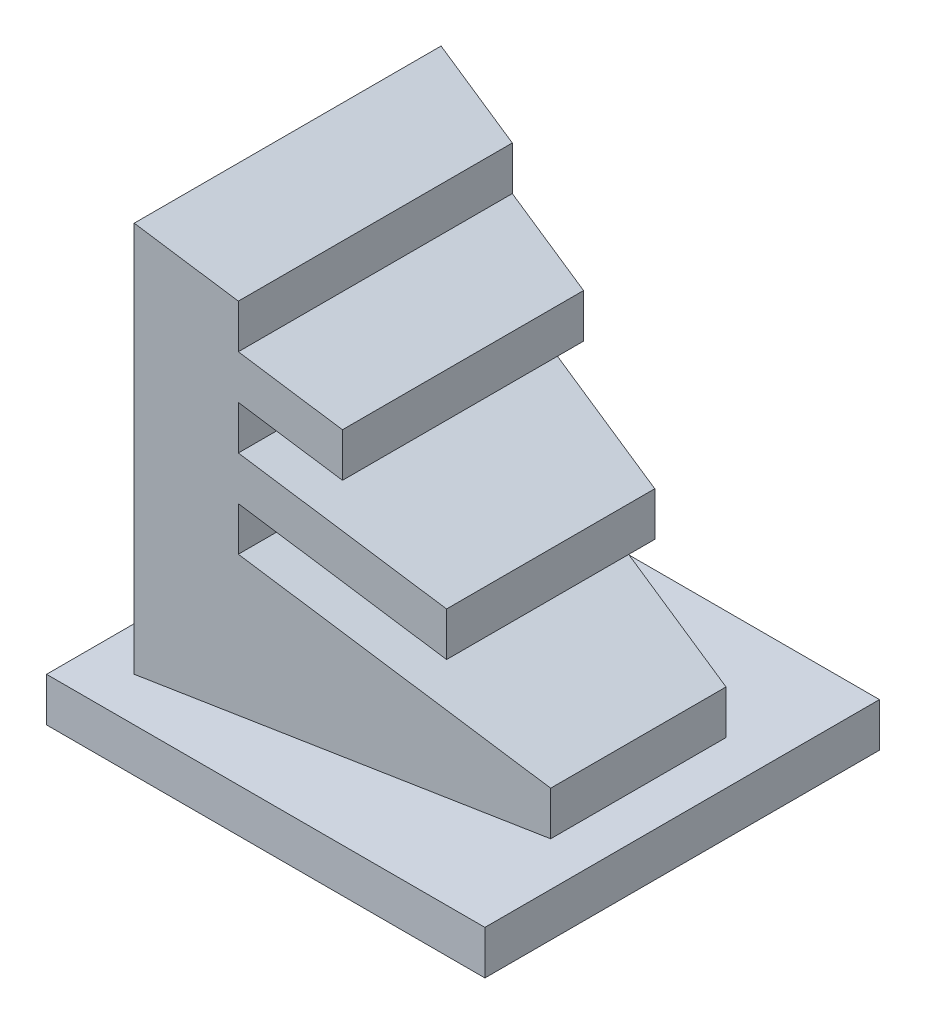
ISO-10303-21;
HEADER;
FILE_DESCRIPTION(('STEP AP214'),'2;1');
FILE_NAME('part.step','',(''),(''),'','','');
FILE_SCHEMA(('AUTOMOTIVE_DESIGN { 1 0 10303 214 1 1 1 1 }'));
ENDSEC;
DATA;
#1=APPLICATION_CONTEXT('core data for automotive mechanical design processes');
#2=APPLICATION_PROTOCOL_DEFINITION('international standard','automotive_design',2000,#1);
#3=PRODUCT_CONTEXT('',#1,'mechanical');
#4=PRODUCT('Part','Part','',(#3));
#5=PRODUCT_RELATED_PRODUCT_CATEGORY('part','',(#4));
#6=PRODUCT_DEFINITION_FORMATION('','',#4);
#7=PRODUCT_DEFINITION_CONTEXT('part definition',#1,'design');
#8=PRODUCT_DEFINITION('design','',#6,#7);
#9=PRODUCT_DEFINITION_SHAPE('','',#8);
#10=(LENGTH_UNIT() NAMED_UNIT(*) SI_UNIT(.MILLI.,.METRE.));
#11=(NAMED_UNIT(*) PLANE_ANGLE_UNIT() SI_UNIT($,.RADIAN.));
#12=(NAMED_UNIT(*) SI_UNIT($,.STERADIAN.) SOLID_ANGLE_UNIT());
#13=UNCERTAINTY_MEASURE_WITH_UNIT(LENGTH_MEASURE(1.E-05),#10,'distance_accuracy_value','');
#14=(GEOMETRIC_REPRESENTATION_CONTEXT(3) GLOBAL_UNCERTAINTY_ASSIGNED_CONTEXT((#13)) GLOBAL_UNIT_ASSIGNED_CONTEXT((#10,
#11,#12)) REPRESENTATION_CONTEXT('',''));
#15=CARTESIAN_POINT('',(0.,0.,0.));
#16=DIRECTION('',(0.,0.,1.));
#17=DIRECTION('',(1.,0.,0.));
#18=AXIS2_PLACEMENT_3D('',#15,#16,#17);
#19=CARTESIAN_POINT('',(0.,99.118,0.));
#20=DIRECTION('',(-1.,0.,0.));
#21=DIRECTION('',(0.,0.,1.));
#22=AXIS2_PLACEMENT_3D('',#19,#20,#21);
#23=PLANE('',#22);
#24=DIRECTION('',(0.,0.,1.));
#25=VECTOR('',#24,1.);
#26=CARTESIAN_POINT('',(0.,20.0003812587038,-64.559));
#27=LINE('',#26,#25);
#28=CARTESIAN_POINT('',(0.,20.0003812587038,-40.));
#29=VERTEX_POINT('',#28);
#30=CARTESIAN_POINT('',(0.,20.0003812587038,0.));
#31=VERTEX_POINT('',#30);
#32=EDGE_CURVE('E166',#29,#31,#27,.T.);
#33=ORIENTED_EDGE('',*,*,#32,.T.);
#34=DIRECTION('',(0.,-1.,0.));
#35=VECTOR('',#34,1.);
#36=CARTESIAN_POINT('',(0.,99.118,0.));
#37=LINE('',#36,#35);
#38=CARTESIAN_POINT('',(0.,10.,0.));
#39=VERTEX_POINT('',#38);
#40=EDGE_CURVE('E192',#31,#39,#37,.T.);
#41=ORIENTED_EDGE('',*,*,#40,.T.);
#42=DIRECTION('',(0.,0.,-1.));
#43=VECTOR('',#42,1.);
#44=CARTESIAN_POINT('',(0.,10.,0.));
#45=LINE('',#44,#43);
#46=CARTESIAN_POINT('',(0.,10.,-40.));
#47=VERTEX_POINT('',#46);
#48=EDGE_CURVE('E190',#39,#47,#45,.T.);
#49=ORIENTED_EDGE('',*,*,#48,.T.);
#50=DIRECTION('',(0.,-1.,0.));
#51=VECTOR('',#50,1.);
#52=CARTESIAN_POINT('',(0.,99.118,-40.));
#53=LINE('',#52,#51);
#54=EDGE_CURVE('E183',#29,#47,#53,.T.);
#55=ORIENTED_EDGE('',*,*,#54,.F.);
#56=EDGE_LOOP('',(#33,#41,#49,#55));
#57=FACE_BOUND('',#56,.T.);
#58=ADVANCED_FACE('F32',(#57),#23,.F.);
#59=CARTESIAN_POINT('',(-90.,10.,25.));
#60=DIRECTION('',(0.,1.,0.));
#61=DIRECTION('',(0.,0.,1.));
#62=AXIS2_PLACEMENT_3D('',#59,#60,#61);
#63=PLANE('',#62);
#64=DIRECTION('',(0.,0.,1.));
#65=VECTOR('',#64,1.);
#66=CARTESIAN_POINT('',(-90.,10.,-65.));
#67=LINE('',#66,#65);
#68=CARTESIAN_POINT('',(-90.,10.,-65.));
#69=VERTEX_POINT('',#68);
#70=CARTESIAN_POINT('',(-90.,10.,25.));
#71=VERTEX_POINT('',#70);
#72=EDGE_CURVE('E200',#69,#71,#67,.T.);
#73=ORIENTED_EDGE('',*,*,#72,.T.);
#74=DIRECTION('',(1.,0.,0.));
#75=VECTOR('',#74,1.);
#76=CARTESIAN_POINT('',(-90.,10.,25.));
#77=LINE('',#76,#75);
#78=CARTESIAN_POINT('',(10.,10.,25.));
#79=VERTEX_POINT('',#78);
#80=EDGE_CURVE('E85',#71,#79,#77,.T.);
#81=ORIENTED_EDGE('',*,*,#80,.T.);
#82=DIRECTION('',(0.,0.,-1.));
#83=VECTOR('',#82,1.);
#84=CARTESIAN_POINT('',(9.99999999999999,10.,-65.));
#85=LINE('',#84,#83);
#86=CARTESIAN_POINT('',(9.99999999999999,10.,-65.));
#87=VERTEX_POINT('',#86);
#88=EDGE_CURVE('E203',#79,#87,#85,.T.);
#89=ORIENTED_EDGE('',*,*,#88,.T.);
#90=DIRECTION('',(-1.,0.,0.));
#91=VECTOR('',#90,1.);
#92=CARTESIAN_POINT('',(-90.,10.,-65.));
#93=LINE('',#92,#91);
#94=EDGE_CURVE('E56',#87,#69,#93,.T.);
#95=ORIENTED_EDGE('',*,*,#94,.T.);
#96=EDGE_LOOP('',(#73,#81,#89,#95));
#97=FACE_BOUND('',#96,.T.);
#98=ORIENTED_EDGE('',*,*,#48,.F.);
#99=DIRECTION('',(0.982872186934322,0.,-0.184288535050185));
#100=VECTOR('',#99,1.);
#101=CARTESIAN_POINT('',(-80.,10.,15.));
#102=LINE('',#101,#100);
#103=CARTESIAN_POINT('',(-80.,10.,15.));
#104=VERTEX_POINT('',#103);
#105=EDGE_CURVE('E291',#104,#39,#102,.T.);
#106=ORIENTED_EDGE('',*,*,#105,.F.);
#107=DIRECTION('',(0.,0.,1.));
#108=VECTOR('',#107,1.);
#109=CARTESIAN_POINT('',(-80.,10.,-55.));
#110=LINE('',#109,#108);
#111=CARTESIAN_POINT('',(-80.,10.,-55.));
#112=VERTEX_POINT('',#111);
#113=EDGE_CURVE('E294',#112,#104,#110,.T.);
#114=ORIENTED_EDGE('',*,*,#113,.F.);
#115=DIRECTION('',(-0.982872186934322,0.,-0.184288535050185));
#116=VECTOR('',#115,1.);
#117=CARTESIAN_POINT('',(0.,10.,-40.));
#118=LINE('',#117,#116);
#119=EDGE_CURVE('E298',#47,#112,#118,.T.);
#120=ORIENTED_EDGE('',*,*,#119,.F.);
#121=EDGE_LOOP('',(#98,#106,#114,#120));
#122=FACE_BOUND('',#121,.T.);
#123=ADVANCED_FACE('F307',(#97,#122),#63,.T.);
#124=CARTESIAN_POINT('',(-90.,10.,-65.));
#125=DIRECTION('',(1.,0.,0.));
#126=DIRECTION('',(0.,0.,-1.));
#127=AXIS2_PLACEMENT_3D('',#124,#125,#126);
#128=PLANE('',#127);
#129=DIRECTION('',(0.,0.,1.));
#130=VECTOR('',#129,1.);
#131=CARTESIAN_POINT('',(-90.,0.,-65.));
#132=LINE('',#131,#130);
#133=CARTESIAN_POINT('',(-90.,0.,-65.));
#134=VERTEX_POINT('',#133);
#135=CARTESIAN_POINT('',(-90.,0.,25.));
#136=VERTEX_POINT('',#135);
#137=EDGE_CURVE('E194',#134,#136,#132,.T.);
#138=ORIENTED_EDGE('',*,*,#137,.T.);
#139=DIRECTION('',(0.,-1.,0.));
#140=VECTOR('',#139,1.);
#141=CARTESIAN_POINT('',(-90.,10.,25.));
#142=LINE('',#141,#140);
#143=EDGE_CURVE('E220',#71,#136,#142,.T.);
#144=ORIENTED_EDGE('',*,*,#143,.F.);
#145=ORIENTED_EDGE('',*,*,#72,.F.);
#146=DIRECTION('',(0.,-1.,0.));
#147=VECTOR('',#146,1.);
#148=CARTESIAN_POINT('',(-90.,10.,-65.));
#149=LINE('',#148,#147);
#150=EDGE_CURVE('E206',#69,#134,#149,.T.);
#151=ORIENTED_EDGE('',*,*,#150,.T.);
#152=EDGE_LOOP('',(#138,#144,#145,#151));
#153=FACE_BOUND('',#152,.T.);
#154=ADVANCED_FACE('F34',(#153),#128,.F.);
#155=CARTESIAN_POINT('',(-90.,10.,25.));
#156=DIRECTION('',(0.,0.,-1.));
#157=DIRECTION('',(-1.,0.,0.));
#158=AXIS2_PLACEMENT_3D('',#155,#156,#157);
#159=PLANE('',#158);
#160=DIRECTION('',(1.,0.,0.));
#161=VECTOR('',#160,1.);
#162=CARTESIAN_POINT('',(-90.,0.,25.));
#163=LINE('',#162,#161);
#164=CARTESIAN_POINT('',(10.,0.,25.));
#165=VERTEX_POINT('',#164);
#166=EDGE_CURVE('E209',#136,#165,#163,.T.);
#167=ORIENTED_EDGE('',*,*,#166,.T.);
#168=DIRECTION('',(0.,-1.,0.));
#169=VECTOR('',#168,1.);
#170=CARTESIAN_POINT('',(10.,10.,25.));
#171=LINE('',#170,#169);
#172=EDGE_CURVE('E217',#79,#165,#171,.T.);
#173=ORIENTED_EDGE('',*,*,#172,.F.);
#174=ORIENTED_EDGE('',*,*,#80,.F.);
#175=ORIENTED_EDGE('',*,*,#143,.T.);
#176=EDGE_LOOP('',(#167,#173,#174,#175));
#177=FACE_BOUND('',#176,.T.);
#178=ADVANCED_FACE('F338',(#177),#159,.F.);
#179=CARTESIAN_POINT('',(9.99999999999999,10.,-65.));
#180=DIRECTION('',(-1.,0.,0.));
#181=DIRECTION('',(0.,0.,1.));
#182=AXIS2_PLACEMENT_3D('',#179,#180,#181);
#183=PLANE('',#182);
#184=DIRECTION('',(0.,0.,-1.));
#185=VECTOR('',#184,1.);
#186=CARTESIAN_POINT('',(9.99999999999999,0.,-65.));
#187=LINE('',#186,#185);
#188=CARTESIAN_POINT('',(9.99999999999999,0.,-65.));
#189=VERTEX_POINT('',#188);
#190=EDGE_CURVE('E211',#165,#189,#187,.T.);
#191=ORIENTED_EDGE('',*,*,#190,.T.);
#192=DIRECTION('',(0.,-1.,0.));
#193=VECTOR('',#192,1.);
#194=CARTESIAN_POINT('',(9.99999999999999,10.,-65.));
#195=LINE('',#194,#193);
#196=EDGE_CURVE('E215',#87,#189,#195,.T.);
#197=ORIENTED_EDGE('',*,*,#196,.F.);
#198=ORIENTED_EDGE('',*,*,#88,.F.);
#199=ORIENTED_EDGE('',*,*,#172,.T.);
#200=EDGE_LOOP('',(#191,#197,#198,#199));
#201=FACE_BOUND('',#200,.T.);
#202=ADVANCED_FACE('F336',(#201),#183,.F.);
#203=CARTESIAN_POINT('',(-90.,10.,-65.));
#204=DIRECTION('',(0.,0.,1.));
#205=DIRECTION('',(1.,0.,0.));
#206=AXIS2_PLACEMENT_3D('',#203,#204,#205);
#207=PLANE('',#206);
#208=DIRECTION('',(-1.,0.,0.));
#209=VECTOR('',#208,1.);
#210=CARTESIAN_POINT('',(-90.,0.,-65.));
#211=LINE('',#210,#209);
#212=EDGE_CURVE('E77',#189,#134,#211,.T.);
#213=ORIENTED_EDGE('',*,*,#212,.T.);
#214=ORIENTED_EDGE('',*,*,#150,.F.);
#215=ORIENTED_EDGE('',*,*,#94,.F.);
#216=ORIENTED_EDGE('',*,*,#196,.T.);
#217=EDGE_LOOP('',(#213,#214,#215,#216));
#218=FACE_BOUND('',#217,.T.);
#219=ADVANCED_FACE('F332',(#218),#207,.F.);
#220=CARTESIAN_POINT('',(-90.,0.,25.));
#221=DIRECTION('',(0.,1.,0.));
#222=DIRECTION('',(0.,0.,1.));
#223=AXIS2_PLACEMENT_3D('',#220,#221,#222);
#224=PLANE('',#223);
#225=ORIENTED_EDGE('',*,*,#137,.F.);
#226=ORIENTED_EDGE('',*,*,#212,.F.);
#227=ORIENTED_EDGE('',*,*,#190,.F.);
#228=ORIENTED_EDGE('',*,*,#166,.F.);
#229=EDGE_LOOP('',(#225,#226,#227,#228));
#230=FACE_BOUND('',#229,.T.);
#231=ADVANCED_FACE('F328',(#230),#224,.F.);
#232=CARTESIAN_POINT('',(-80.,99.118,15.));
#233=DIRECTION('',(-0.184288535050185,0.,-0.982872186934322));
#234=DIRECTION('',(-0.982872186934322,0.,0.184288535050185));
#235=AXIS2_PLACEMENT_3D('',#232,#233,#234);
#236=PLANE('',#235);
#237=DIRECTION('',(0.,-1.,0.));
#238=VECTOR('',#237,1.);
#239=CARTESIAN_POINT('',(-60.,99.118,11.25));
#240=LINE('',#239,#238);
#241=CARTESIAN_POINT('',(-60.,91.8385953146759,11.25));
#242=VERTEX_POINT('',#241);
#243=CARTESIAN_POINT('',(-60.,81.8385953146759,11.25));
#244=VERTEX_POINT('',#243);
#245=EDGE_CURVE('E252',#242,#244,#240,.T.);
#246=ORIENTED_EDGE('',*,*,#245,.F.);
#247=DIRECTION('',(-0.925437874464067,0.336831839967503,0.173519601462013));
#248=VECTOR('',#247,1.);
#249=CARTESIAN_POINT('',(-80.,99.118,15.));
#250=LINE('',#249,#248);
#251=CARTESIAN_POINT('',(-80.,99.118,15.));
#252=VERTEX_POINT('',#251);
#253=EDGE_CURVE('E257',#242,#252,#250,.T.);
#254=ORIENTED_EDGE('',*,*,#253,.T.);
#255=DIRECTION('',(0.,-1.,0.));
#256=VECTOR('',#255,1.);
#257=CARTESIAN_POINT('',(-80.,99.118,15.));
#258=LINE('',#257,#256);
#259=EDGE_CURVE('E196',#252,#104,#258,.T.);
#260=ORIENTED_EDGE('',*,*,#259,.T.);
#261=ORIENTED_EDGE('',*,*,#105,.T.);
#262=ORIENTED_EDGE('',*,*,#40,.F.);
#263=DIRECTION('',(0.925437874464068,-0.336831839967503,-0.173519601462013));
#264=VECTOR('',#263,1.);
#265=CARTESIAN_POINT('',(-95.5858471015673,54.7907844207946,17.9223463315439));
#266=LINE('',#265,#264);
#267=CARTESIAN_POINT('',(-60.,41.8385953146759,11.25));
#268=VERTEX_POINT('',#267);
#269=EDGE_CURVE('E173',#268,#31,#266,.T.);
#270=ORIENTED_EDGE('',*,*,#269,.F.);
#271=DIRECTION('',(0.,1.,0.));
#272=VECTOR('',#271,1.);
#273=CARTESIAN_POINT('',(-60.,99.118,11.25));
#274=LINE('',#273,#272);
#275=CARTESIAN_POINT('',(-60.,51.8385953146759,11.25));
#276=VERTEX_POINT('',#275);
#277=EDGE_CURVE('E274',#268,#276,#274,.T.);
#278=ORIENTED_EDGE('',*,*,#277,.T.);
#279=DIRECTION('',(-0.925437874464068,0.336831839967502,0.173519601462013));
#280=VECTOR('',#279,1.);
#281=CARTESIAN_POINT('',(-92.4686776812539,63.6562275366357,17.3378770652351));
#282=LINE('',#281,#280);
#283=CARTESIAN_POINT('',(-20.,37.2797859440279,3.74999999999999));
#284=VERTEX_POINT('',#283);
#285=EDGE_CURVE('E272',#284,#276,#282,.T.);
#286=ORIENTED_EDGE('',*,*,#285,.F.);
#287=DIRECTION('',(0.,1.,0.));
#288=VECTOR('',#287,1.);
#289=CARTESIAN_POINT('',(-20.,99.118,3.75));
#290=LINE('',#289,#288);
#291=CARTESIAN_POINT('',(-20.,47.2797859440279,3.74999999999999));
#292=VERTEX_POINT('',#291);
#293=EDGE_CURVE('E261',#284,#292,#290,.T.);
#294=ORIENTED_EDGE('',*,*,#293,.T.);
#295=DIRECTION('',(0.925437874464068,-0.336831839967502,-0.173519601462013));
#296=VECTOR('',#295,1.);
#297=CARTESIAN_POINT('',(-89.3515082609404,72.5216706524768,16.7534077989263));
#298=LINE('',#297,#296);
#299=CARTESIAN_POINT('',(-60.,61.8385953146759,11.25));
#300=VERTEX_POINT('',#299);
#301=EDGE_CURVE('E289',#300,#292,#298,.T.);
#302=ORIENTED_EDGE('',*,*,#301,.F.);
#303=DIRECTION('',(0.,1.,0.));
#304=VECTOR('',#303,1.);
#305=CARTESIAN_POINT('',(-60.,99.118,11.25));
#306=LINE('',#305,#304);
#307=CARTESIAN_POINT('',(-60.,71.8385953146759,11.25));
#308=VERTEX_POINT('',#307);
#309=EDGE_CURVE('E286',#300,#308,#306,.T.);
#310=ORIENTED_EDGE('',*,*,#309,.T.);
#311=DIRECTION('',(-0.925437874464067,0.336831839967502,0.173519601462013));
#312=VECTOR('',#311,1.);
#313=CARTESIAN_POINT('',(-86.2343388406269,81.3871137683178,16.1689385326176));
#314=LINE('',#313,#312);
#315=CARTESIAN_POINT('',(-40.,64.5591906293519,7.49999999999999));
#316=VERTEX_POINT('',#315);
#317=EDGE_CURVE('E284',#316,#308,#314,.T.);
#318=ORIENTED_EDGE('',*,*,#317,.F.);
#319=DIRECTION('',(0.,1.,0.));
#320=VECTOR('',#319,1.);
#321=CARTESIAN_POINT('',(-40.,99.118,7.5));
#322=LINE('',#321,#320);
#323=CARTESIAN_POINT('',(-40.,74.5591906293519,7.50000000000001));
#324=VERTEX_POINT('',#323);
#325=EDGE_CURVE('E281',#316,#324,#322,.T.);
#326=ORIENTED_EDGE('',*,*,#325,.T.);
#327=DIRECTION('',(0.925437874464067,-0.336831839967503,-0.173519601462013));
#328=VECTOR('',#327,1.);
#329=CARTESIAN_POINT('',(-83.1171694203135,90.2525568841589,15.5844692663088));
#330=LINE('',#329,#328);
#331=EDGE_CURVE('E279',#244,#324,#330,.T.);
#332=ORIENTED_EDGE('',*,*,#331,.F.);
#333=EDGE_LOOP('',(#246,#254,#260,#261,#262,#270,#278,#286,#294,#302,#310,#318,#326,#332));
#334=FACE_BOUND('',#333,.T.);
#335=ADVANCED_FACE('F304',(#334),#236,.F.);
#336=CARTESIAN_POINT('',(0.,99.118,-40.));
#337=DIRECTION('',(-0.184288535050185,0.,0.982872186934322));
#338=DIRECTION('',(0.982872186934322,0.,0.184288535050185));
#339=AXIS2_PLACEMENT_3D('',#336,#337,#338);
#340=PLANE('',#339);
#341=DIRECTION('',(0.,-1.,0.));
#342=VECTOR('',#341,1.);
#343=CARTESIAN_POINT('',(-80.,99.118,-55.));
#344=LINE('',#343,#342);
#345=CARTESIAN_POINT('',(-80.,99.118,-55.));
#346=VERTEX_POINT('',#345);
#347=EDGE_CURVE('E47',#346,#112,#344,.T.);
#348=ORIENTED_EDGE('',*,*,#347,.F.);
#349=DIRECTION('',(0.925437874464067,-0.336831839967503,0.173519601462013));
#350=VECTOR('',#349,1.);
#351=CARTESIAN_POINT('',(-9.07645507327149,73.3039407380291,-41.7018353262384));
#352=LINE('',#351,#350);
#353=CARTESIAN_POINT('',(-60.,91.8385953146759,-51.25));
#354=VERTEX_POINT('',#353);
#355=EDGE_CURVE('E255',#346,#354,#352,.T.);
#356=ORIENTED_EDGE('',*,*,#355,.T.);
#357=DIRECTION('',(0.,1.,0.));
#358=VECTOR('',#357,1.);
#359=CARTESIAN_POINT('',(-60.,99.118,-51.25));
#360=LINE('',#359,#358);
#361=CARTESIAN_POINT('',(-60.,81.8385953146759,-51.25));
#362=VERTEX_POINT('',#361);
#363=EDGE_CURVE('E12',#362,#354,#360,.T.);
#364=ORIENTED_EDGE('',*,*,#363,.F.);
#365=DIRECTION('',(-0.925437874464067,0.336831839967503,-0.173519601462013));
#366=VECTOR('',#365,1.);
#367=CARTESIAN_POINT('',(-12.193624493585,64.438497622188,-42.2863045925472));
#368=LINE('',#367,#366);
#369=CARTESIAN_POINT('',(-40.,74.5591906293519,-47.5));
#370=VERTEX_POINT('',#369);
#371=EDGE_CURVE('E40',#370,#362,#368,.T.);
#372=ORIENTED_EDGE('',*,*,#371,.F.);
#373=DIRECTION('',(0.,-1.,0.));
#374=VECTOR('',#373,1.);
#375=CARTESIAN_POINT('',(-40.,99.118,-47.5));
#376=LINE('',#375,#374);
#377=CARTESIAN_POINT('',(-40.,64.5591906293519,-47.5));
#378=VERTEX_POINT('',#377);
#379=EDGE_CURVE('E234',#370,#378,#376,.T.);
#380=ORIENTED_EDGE('',*,*,#379,.T.);
#381=DIRECTION('',(0.925437874464067,-0.336831839967502,0.173519601462013));
#382=VECTOR('',#381,1.);
#383=CARTESIAN_POINT('',(-15.3107939138984,55.573054506347,-42.8707738588559));
#384=LINE('',#383,#382);
#385=CARTESIAN_POINT('',(-60.,71.8385953146759,-51.25));
#386=VERTEX_POINT('',#385);
#387=EDGE_CURVE('E232',#386,#378,#384,.T.);
#388=ORIENTED_EDGE('',*,*,#387,.F.);
#389=DIRECTION('',(0.,-1.,0.));
#390=VECTOR('',#389,1.);
#391=CARTESIAN_POINT('',(-60.,99.118,-51.25));
#392=LINE('',#391,#390);
#393=CARTESIAN_POINT('',(-60.,61.8385953146759,-51.25));
#394=VERTEX_POINT('',#393);
#395=EDGE_CURVE('E229',#386,#394,#392,.T.);
#396=ORIENTED_EDGE('',*,*,#395,.T.);
#397=DIRECTION('',(-0.925437874464068,0.336831839967502,-0.173519601462013));
#398=VECTOR('',#397,1.);
#399=CARTESIAN_POINT('',(-18.4279633342118,46.7076113905059,-43.4552431251647));
#400=LINE('',#399,#398);
#401=CARTESIAN_POINT('',(-20.,47.2797859440279,-43.75));
#402=VERTEX_POINT('',#401);
#403=EDGE_CURVE('E187',#402,#394,#400,.T.);
#404=ORIENTED_EDGE('',*,*,#403,.F.);
#405=DIRECTION('',(0.,-1.,0.));
#406=VECTOR('',#405,1.);
#407=CARTESIAN_POINT('',(-20.,99.118,-43.75));
#408=LINE('',#407,#406);
#409=CARTESIAN_POINT('',(-20.,37.2797859440279,-43.75));
#410=VERTEX_POINT('',#409);
#411=EDGE_CURVE('E222',#402,#410,#408,.T.);
#412=ORIENTED_EDGE('',*,*,#411,.T.);
#413=DIRECTION('',(0.925437874464068,-0.336831839967502,0.173519601462013));
#414=VECTOR('',#413,1.);
#415=CARTESIAN_POINT('',(-21.5451327545253,37.8421682746648,-44.0397123914735));
#416=LINE('',#415,#414);
#417=CARTESIAN_POINT('',(-60.,51.8385953146759,-51.25));
#418=VERTEX_POINT('',#417);
#419=EDGE_CURVE('E225',#418,#410,#416,.T.);
#420=ORIENTED_EDGE('',*,*,#419,.F.);
#421=DIRECTION('',(0.,-1.,0.));
#422=VECTOR('',#421,1.);
#423=CARTESIAN_POINT('',(-60.,99.118,-51.25));
#424=LINE('',#423,#422);
#425=CARTESIAN_POINT('',(-60.,41.8385953146759,-51.25));
#426=VERTEX_POINT('',#425);
#427=EDGE_CURVE('E186',#418,#426,#424,.T.);
#428=ORIENTED_EDGE('',*,*,#427,.T.);
#429=DIRECTION('',(-0.925437874464068,0.336831839967503,-0.173519601462013));
#430=VECTOR('',#429,1.);
#431=CARTESIAN_POINT('',(-24.6623021748388,28.9767251588238,-44.6241816577823));
#432=LINE('',#431,#430);
#433=EDGE_CURVE('E170',#29,#426,#432,.T.);
#434=ORIENTED_EDGE('',*,*,#433,.F.);
#435=ORIENTED_EDGE('',*,*,#54,.T.);
#436=ORIENTED_EDGE('',*,*,#119,.T.);
#437=EDGE_LOOP('',(#348,#356,#364,#372,#380,#388,#396,#404,#412,#420,#428,#434,#435,#436));
#438=FACE_BOUND('',#437,.T.);
#439=ADVANCED_FACE('F182',(#438),#340,.F.);
#440=CARTESIAN_POINT('',(-80.,99.118,-55.));
#441=DIRECTION('',(1.,0.,0.));
#442=DIRECTION('',(0.,0.,-1.));
#443=AXIS2_PLACEMENT_3D('',#440,#441,#442);
#444=PLANE('',#443);
#445=ORIENTED_EDGE('',*,*,#113,.T.);
#446=ORIENTED_EDGE('',*,*,#259,.F.);
#447=DIRECTION('',(0.,0.,1.));
#448=VECTOR('',#447,1.);
#449=CARTESIAN_POINT('',(-80.,99.118,-55.));
#450=LINE('',#449,#448);
#451=EDGE_CURVE('E292',#346,#252,#450,.T.);
#452=ORIENTED_EDGE('',*,*,#451,.F.);
#453=ORIENTED_EDGE('',*,*,#347,.T.);
#454=EDGE_LOOP('',(#445,#446,#452,#453));
#455=FACE_BOUND('',#454,.T.);
#456=ADVANCED_FACE('F308',(#455),#444,.F.);
#457=CARTESIAN_POINT('',(-10.0167889121464,43.6461942656528,-64.559));
#458=DIRECTION('',(0.342020143325668,0.939692620785909,0.));
#459=DIRECTION('',(-0.939692620785909,0.342020143325668,0.));
#460=AXIS2_PLACEMENT_3D('',#457,#458,#459);
#461=PLANE('',#460);
#462=ORIENTED_EDGE('',*,*,#301,.T.);
#463=DIRECTION('',(0.,0.,1.));
#464=VECTOR('',#463,1.);
#465=CARTESIAN_POINT('',(-20.,47.2797859440279,-64.559));
#466=LINE('',#465,#464);
#467=EDGE_CURVE('E267',#402,#292,#466,.T.);
#468=ORIENTED_EDGE('',*,*,#467,.F.);
#469=ORIENTED_EDGE('',*,*,#403,.T.);
#470=DIRECTION('',(0.,0.,1.));
#471=VECTOR('',#470,1.);
#472=CARTESIAN_POINT('',(-60.,61.8385953146759,-64.559));
#473=LINE('',#472,#471);
#474=EDGE_CURVE('E258',#394,#300,#473,.T.);
#475=ORIENTED_EDGE('',*,*,#474,.T.);
#476=EDGE_LOOP('',(#462,#468,#469,#475));
#477=FACE_BOUND('',#476,.T.);
#478=ADVANCED_FACE('F310',(#477),#461,.T.);
#479=CARTESIAN_POINT('',(-60.,-38.7320011609666,-64.559));
#480=DIRECTION('',(-1.,0.,0.));
#481=DIRECTION('',(0.,0.,1.));
#482=AXIS2_PLACEMENT_3D('',#479,#480,#481);
#483=PLANE('',#482);
#484=ORIENTED_EDGE('',*,*,#474,.F.);
#485=ORIENTED_EDGE('',*,*,#395,.F.);
#486=DIRECTION('',(0.,0.,1.));
#487=VECTOR('',#486,1.);
#488=CARTESIAN_POINT('',(-60.,71.8385953146759,-64.559));
#489=LINE('',#488,#487);
#490=EDGE_CURVE('E264',#386,#308,#489,.T.);
#491=ORIENTED_EDGE('',*,*,#490,.T.);
#492=ORIENTED_EDGE('',*,*,#309,.F.);
#493=EDGE_LOOP('',(#484,#485,#491,#492));
#494=FACE_BOUND('',#493,.T.);
#495=ADVANCED_FACE('F316',(#494),#483,.F.);
#496=CARTESIAN_POINT('',(-6.80285086371367,52.4764164812477,-64.559));
#497=DIRECTION('',(-0.342020143325668,-0.939692620785909,0.));
#498=DIRECTION('',(0.939692620785909,-0.342020143325668,0.));
#499=AXIS2_PLACEMENT_3D('',#496,#497,#498);
#500=PLANE('',#499);
#501=ORIENTED_EDGE('',*,*,#317,.T.);
#502=ORIENTED_EDGE('',*,*,#490,.F.);
#503=ORIENTED_EDGE('',*,*,#387,.T.);
#504=DIRECTION('',(0.,0.,1.));
#505=VECTOR('',#504,1.);
#506=CARTESIAN_POINT('',(-40.,64.5591906293519,-64.559));
#507=LINE('',#506,#505);
#508=EDGE_CURVE('E505',#378,#316,#507,.T.);
#509=ORIENTED_EDGE('',*,*,#508,.T.);
#510=EDGE_LOOP('',(#501,#502,#503,#509));
#511=FACE_BOUND('',#510,.T.);
#512=ADVANCED_FACE('F396',(#511),#500,.T.);
#513=CARTESIAN_POINT('',(-40.,-38.7320011609666,-64.559));
#514=DIRECTION('',(-1.,0.,0.));
#515=DIRECTION('',(0.,0.,1.));
#516=AXIS2_PLACEMENT_3D('',#513,#514,#515);
#517=PLANE('',#516);
#518=ORIENTED_EDGE('',*,*,#508,.F.);
#519=ORIENTED_EDGE('',*,*,#379,.F.);
#520=DIRECTION('',(0.,0.,1.));
#521=VECTOR('',#520,1.);
#522=CARTESIAN_POINT('',(-40.,74.5591906293519,-64.559));
#523=LINE('',#522,#521);
#524=EDGE_CURVE('E245',#370,#324,#523,.T.);
#525=ORIENTED_EDGE('',*,*,#524,.T.);
#526=ORIENTED_EDGE('',*,*,#325,.F.);
#527=EDGE_LOOP('',(#518,#519,#525,#526));
#528=FACE_BOUND('',#527,.T.);
#529=ADVANCED_FACE('F406',(#528),#517,.F.);
#530=CARTESIAN_POINT('',(-3.58891281528092,61.3066386968426,-64.559));
#531=DIRECTION('',(0.342020143325669,0.939692620785909,0.));
#532=DIRECTION('',(-0.939692620785908,0.342020143325669,0.));
#533=AXIS2_PLACEMENT_3D('',#530,#531,#532);
#534=PLANE('',#533);
#535=ORIENTED_EDGE('',*,*,#331,.T.);
#536=ORIENTED_EDGE('',*,*,#524,.F.);
#537=ORIENTED_EDGE('',*,*,#371,.T.);
#538=DIRECTION('',(0.,0.,1.));
#539=VECTOR('',#538,1.);
#540=CARTESIAN_POINT('',(-60.,81.8385953146759,-64.559));
#541=LINE('',#540,#539);
#542=EDGE_CURVE('E242',#362,#244,#541,.T.);
#543=ORIENTED_EDGE('',*,*,#542,.T.);
#544=EDGE_LOOP('',(#535,#536,#537,#543));
#545=FACE_BOUND('',#544,.T.);
#546=ADVANCED_FACE('F241',(#545),#534,.T.);
#547=CARTESIAN_POINT('',(-60.,-38.7320011609666,-64.559));
#548=DIRECTION('',(1.,0.,0.));
#549=DIRECTION('',(0.,0.,-1.));
#550=AXIS2_PLACEMENT_3D('',#547,#548,#549);
#551=PLANE('',#550);
#552=ORIENTED_EDGE('',*,*,#245,.T.);
#553=ORIENTED_EDGE('',*,*,#542,.F.);
#554=ORIENTED_EDGE('',*,*,#363,.T.);
#555=DIRECTION('',(0.,0.,1.));
#556=VECTOR('',#555,1.);
#557=CARTESIAN_POINT('',(-60.,91.8385953146759,-64.559));
#558=LINE('',#557,#556);
#559=EDGE_CURVE('E177',#354,#242,#558,.T.);
#560=ORIENTED_EDGE('',*,*,#559,.T.);
#561=EDGE_LOOP('',(#552,#553,#554,#560));
#562=FACE_BOUND('',#561,.T.);
#563=ADVANCED_FACE('F248',(#562),#551,.T.);
#564=CARTESIAN_POINT('',(-16.4446650090117,25.985749834463,-64.559));
#565=DIRECTION('',(0.342020143325668,0.939692620785909,0.));
#566=DIRECTION('',(-0.939692620785909,0.342020143325668,0.));
#567=AXIS2_PLACEMENT_3D('',#564,#565,#566);
#568=PLANE('',#567);
#569=ORIENTED_EDGE('',*,*,#269,.T.);
#570=ORIENTED_EDGE('',*,*,#32,.F.);
#571=ORIENTED_EDGE('',*,*,#433,.T.);
#572=DIRECTION('',(0.,0.,1.));
#573=VECTOR('',#572,1.);
#574=CARTESIAN_POINT('',(-60.,41.8385953146759,-64.559));
#575=LINE('',#574,#573);
#576=EDGE_CURVE('E178',#426,#268,#575,.T.);
#577=ORIENTED_EDGE('',*,*,#576,.T.);
#578=EDGE_LOOP('',(#569,#570,#571,#577));
#579=FACE_BOUND('',#578,.T.);
#580=ADVANCED_FACE('F168',(#579),#568,.T.);
#581=CARTESIAN_POINT('',(-60.,-38.7320011609666,-64.559));
#582=DIRECTION('',(-1.,0.,0.));
#583=DIRECTION('',(0.,0.,1.));
#584=AXIS2_PLACEMENT_3D('',#581,#582,#583);
#585=PLANE('',#584);
#586=ORIENTED_EDGE('',*,*,#576,.F.);
#587=ORIENTED_EDGE('',*,*,#427,.F.);
#588=DIRECTION('',(0.,0.,1.));
#589=VECTOR('',#588,1.);
#590=CARTESIAN_POINT('',(-60.,51.8385953146759,-64.559));
#591=LINE('',#590,#589);
#592=EDGE_CURVE('E487',#418,#276,#591,.T.);
#593=ORIENTED_EDGE('',*,*,#592,.T.);
#594=ORIENTED_EDGE('',*,*,#277,.F.);
#595=EDGE_LOOP('',(#586,#587,#593,#594));
#596=FACE_BOUND('',#595,.T.);
#597=ADVANCED_FACE('F441',(#596),#585,.F.);
#598=CARTESIAN_POINT('',(-13.2307269605791,34.8159720500579,-64.559));
#599=DIRECTION('',(-0.342020143325668,-0.939692620785909,0.));
#600=DIRECTION('',(0.939692620785909,-0.342020143325668,0.));
#601=AXIS2_PLACEMENT_3D('',#598,#599,#600);
#602=PLANE('',#601);
#603=ORIENTED_EDGE('',*,*,#285,.T.);
#604=ORIENTED_EDGE('',*,*,#592,.F.);
#605=ORIENTED_EDGE('',*,*,#419,.T.);
#606=DIRECTION('',(0.,0.,1.));
#607=VECTOR('',#606,1.);
#608=CARTESIAN_POINT('',(-20.,37.2797859440279,-64.559));
#609=LINE('',#608,#607);
#610=EDGE_CURVE('E489',#410,#284,#609,.T.);
#611=ORIENTED_EDGE('',*,*,#610,.T.);
#612=EDGE_LOOP('',(#603,#604,#605,#611));
#613=FACE_BOUND('',#612,.T.);
#614=ADVANCED_FACE('F450',(#613),#602,.T.);
#615=CARTESIAN_POINT('',(-20.,-38.7320011609666,-64.559));
#616=DIRECTION('',(-1.,0.,0.));
#617=DIRECTION('',(0.,0.,1.));
#618=AXIS2_PLACEMENT_3D('',#615,#616,#617);
#619=PLANE('',#618);
#620=ORIENTED_EDGE('',*,*,#610,.F.);
#621=ORIENTED_EDGE('',*,*,#411,.F.);
#622=ORIENTED_EDGE('',*,*,#467,.T.);
#623=ORIENTED_EDGE('',*,*,#293,.F.);
#624=EDGE_LOOP('',(#620,#621,#622,#623));
#625=FACE_BOUND('',#624,.T.);
#626=ADVANCED_FACE('F460',(#625),#619,.F.);
#627=CARTESIAN_POINT('',(-0.374974766848224,70.1368609124374,-64.559));
#628=DIRECTION('',(-0.342020143325669,-0.939692620785909,0.));
#629=DIRECTION('',(0.939692620785908,-0.342020143325669,0.));
#630=AXIS2_PLACEMENT_3D('',#627,#628,#629);
#631=PLANE('',#630);
#632=ORIENTED_EDGE('',*,*,#559,.F.);
#633=ORIENTED_EDGE('',*,*,#355,.F.);
#634=ORIENTED_EDGE('',*,*,#451,.T.);
#635=ORIENTED_EDGE('',*,*,#253,.F.);
#636=EDGE_LOOP('',(#632,#633,#634,#635));
#637=FACE_BOUND('',#636,.T.);
#638=ADVANCED_FACE('F470',(#637),#631,.F.);
#639=CLOSED_SHELL('',(#58,#123,#154,#178,#202,#219,#231,#335,#439,#456,#478,#495,#512,#529,#546,
#563,#580,#597,#614,#626,#638));
#640=MANIFOLD_SOLID_BREP('B2',#639);
#641=ADVANCED_BREP_SHAPE_REPRESENTATION('',(#18,#640),#14);
#642=SHAPE_DEFINITION_REPRESENTATION(#9,#641);
ENDSEC;
END-ISO-10303-21;
